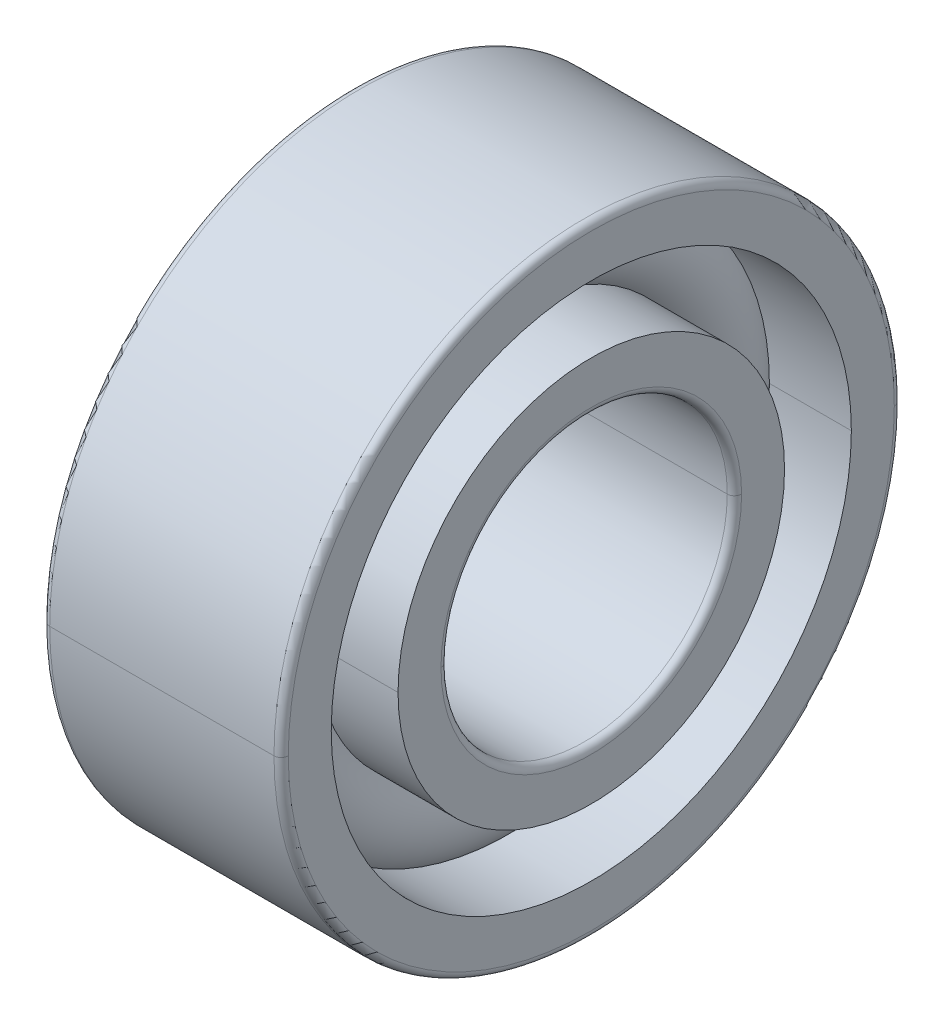
ISO-10303-21;
HEADER;
FILE_DESCRIPTION(('STEP AP214'),'2;1');
FILE_NAME('part.step','',(''),(''),'','','');
FILE_SCHEMA(('AUTOMOTIVE_DESIGN { 1 0 10303 214 1 1 1 1 }'));
ENDSEC;
DATA;
#1=APPLICATION_CONTEXT('core data for automotive mechanical design processes');
#2=APPLICATION_PROTOCOL_DEFINITION('international standard','automotive_design',2000,#1);
#3=PRODUCT_CONTEXT('',#1,'mechanical');
#4=PRODUCT('Part','Part','',(#3));
#5=PRODUCT_RELATED_PRODUCT_CATEGORY('part','',(#4));
#6=PRODUCT_DEFINITION_FORMATION('','',#4);
#7=PRODUCT_DEFINITION_CONTEXT('part definition',#1,'design');
#8=PRODUCT_DEFINITION('design','',#6,#7);
#9=PRODUCT_DEFINITION_SHAPE('','',#8);
#10=(LENGTH_UNIT() NAMED_UNIT(*) SI_UNIT(.MILLI.,.METRE.));
#11=(NAMED_UNIT(*) PLANE_ANGLE_UNIT() SI_UNIT($,.RADIAN.));
#12=(NAMED_UNIT(*) SI_UNIT($,.STERADIAN.) SOLID_ANGLE_UNIT());
#13=UNCERTAINTY_MEASURE_WITH_UNIT(LENGTH_MEASURE(1.E-05),#10,'distance_accuracy_value','');
#14=(GEOMETRIC_REPRESENTATION_CONTEXT(3) GLOBAL_UNCERTAINTY_ASSIGNED_CONTEXT((#13)) GLOBAL_UNIT_ASSIGNED_CONTEXT((#10,
#11,#12)) REPRESENTATION_CONTEXT('',''));
#15=CARTESIAN_POINT('',(0.,0.,0.));
#16=DIRECTION('',(0.,0.,1.));
#17=DIRECTION('',(1.,0.,0.));
#18=AXIS2_PLACEMENT_3D('',#15,#16,#17);
#19=CARTESIAN_POINT('',(-2.35,0.,0.));
#20=DIRECTION('',(1.,0.,0.));
#21=DIRECTION('',(0.,0.,-1.));
#22=AXIS2_PLACEMENT_3D('',#19,#20,#21);
#23=TOROIDAL_SURFACE('',#22,6.35,0.15);
#24=CARTESIAN_POINT('',(-2.5,0.,0.));
#25=DIRECTION('',(1.,0.,0.));
#26=DIRECTION('',(0.,0.,-1.));
#27=AXIS2_PLACEMENT_3D('',#24,#25,#26);
#28=CIRCLE('',#27,6.35);
#29=CARTESIAN_POINT('',(-2.5,0.,-6.35));
#30=VERTEX_POINT('',#29);
#31=CARTESIAN_POINT('',(-2.5,0.,6.35));
#32=VERTEX_POINT('',#31);
#33=EDGE_CURVE('E11',#30,#32,#28,.T.);
#34=ORIENTED_EDGE('',*,*,#33,.T.);
#35=CARTESIAN_POINT('',(-2.35,0.,6.35));
#36=DIRECTION('',(0.,1.,0.));
#37=DIRECTION('',(0.,0.,1.));
#38=AXIS2_PLACEMENT_3D('',#35,#36,#37);
#39=CIRCLE('',#38,0.15);
#40=CARTESIAN_POINT('',(-2.35,0.,6.5));
#41=VERTEX_POINT('',#40);
#42=EDGE_CURVE('E27',#32,#41,#39,.T.);
#43=ORIENTED_EDGE('',*,*,#42,.T.);
#44=CARTESIAN_POINT('',(-2.35,0.,0.));
#45=DIRECTION('',(1.,0.,0.));
#46=DIRECTION('',(0.,0.,-1.));
#47=AXIS2_PLACEMENT_3D('',#44,#45,#46);
#48=CIRCLE('',#47,6.5);
#49=CARTESIAN_POINT('',(-2.35,0.,-6.5));
#50=VERTEX_POINT('',#49);
#51=EDGE_CURVE('E323',#50,#41,#48,.T.);
#52=ORIENTED_EDGE('',*,*,#51,.F.);
#53=CARTESIAN_POINT('',(-2.35,0.,-6.35));
#54=DIRECTION('',(0.,-1.,0.));
#55=DIRECTION('',(0.,0.,-1.));
#56=AXIS2_PLACEMENT_3D('',#53,#54,#55);
#57=CIRCLE('',#56,0.15);
#58=EDGE_CURVE('E358',#30,#50,#57,.T.);
#59=ORIENTED_EDGE('',*,*,#58,.F.);
#60=EDGE_LOOP('',(#34,#43,#52,#59));
#61=FACE_BOUND('',#60,.T.);
#62=ADVANCED_FACE('F16',(#61),#23,.T.);
#63=CARTESIAN_POINT('',(-20.6375,0.,0.));
#64=DIRECTION('',(1.,0.,0.));
#65=DIRECTION('',(0.,0.,-1.));
#66=AXIS2_PLACEMENT_3D('',#63,#64,#65);
#67=CYLINDRICAL_SURFACE('',#66,6.5);
#68=ORIENTED_EDGE('',*,*,#51,.T.);
#69=DIRECTION('',(1.,0.,0.));
#70=VECTOR('',#69,1.);
#71=CARTESIAN_POINT('',(-20.6375,0.,6.5));
#72=LINE('',#71,#70);
#73=CARTESIAN_POINT('',(2.35,0.,6.5));
#74=VERTEX_POINT('',#73);
#75=EDGE_CURVE('E310',#41,#74,#72,.T.);
#76=ORIENTED_EDGE('',*,*,#75,.T.);
#77=CARTESIAN_POINT('',(2.35,0.,0.));
#78=DIRECTION('',(1.,0.,0.));
#79=DIRECTION('',(0.,0.,-1.));
#80=AXIS2_PLACEMENT_3D('',#77,#78,#79);
#81=CIRCLE('',#80,6.5);
#82=CARTESIAN_POINT('',(2.35,0.,-6.5));
#83=VERTEX_POINT('',#82);
#84=EDGE_CURVE('E245',#83,#74,#81,.T.);
#85=ORIENTED_EDGE('',*,*,#84,.F.);
#86=DIRECTION('',(1.,0.,0.));
#87=VECTOR('',#86,1.);
#88=CARTESIAN_POINT('',(-20.6375,0.,-6.5));
#89=LINE('',#88,#87);
#90=EDGE_CURVE('E207',#50,#83,#89,.T.);
#91=ORIENTED_EDGE('',*,*,#90,.F.);
#92=EDGE_LOOP('',(#68,#76,#85,#91));
#93=FACE_BOUND('',#92,.T.);
#94=ADVANCED_FACE('F478',(#93),#67,.T.);
#95=CARTESIAN_POINT('',(2.35,0.,0.));
#96=DIRECTION('',(1.,0.,0.));
#97=DIRECTION('',(0.,0.,-1.));
#98=AXIS2_PLACEMENT_3D('',#95,#96,#97);
#99=TOROIDAL_SURFACE('',#98,6.35,0.15);
#100=ORIENTED_EDGE('',*,*,#84,.T.);
#101=CARTESIAN_POINT('',(2.35,0.,6.35));
#102=DIRECTION('',(0.,1.,0.));
#103=DIRECTION('',(0.,0.,1.));
#104=AXIS2_PLACEMENT_3D('',#101,#102,#103);
#105=CIRCLE('',#104,0.15);
#106=CARTESIAN_POINT('',(2.5,0.,6.35));
#107=VERTEX_POINT('',#106);
#108=EDGE_CURVE('E243',#74,#107,#105,.T.);
#109=ORIENTED_EDGE('',*,*,#108,.T.);
#110=CARTESIAN_POINT('',(2.5,0.,0.));
#111=DIRECTION('',(1.,0.,0.));
#112=DIRECTION('',(0.,0.,-1.));
#113=AXIS2_PLACEMENT_3D('',#110,#111,#112);
#114=CIRCLE('',#113,6.35);
#115=CARTESIAN_POINT('',(2.5,0.,-6.35));
#116=VERTEX_POINT('',#115);
#117=EDGE_CURVE('E213',#116,#107,#114,.T.);
#118=ORIENTED_EDGE('',*,*,#117,.F.);
#119=CARTESIAN_POINT('',(2.35,0.,-6.35));
#120=DIRECTION('',(0.,-1.,0.));
#121=DIRECTION('',(0.,0.,-1.));
#122=AXIS2_PLACEMENT_3D('',#119,#120,#121);
#123=CIRCLE('',#122,0.15);
#124=EDGE_CURVE('E276',#83,#116,#123,.T.);
#125=ORIENTED_EDGE('',*,*,#124,.F.);
#126=EDGE_LOOP('',(#100,#109,#118,#125));
#127=FACE_BOUND('',#126,.T.);
#128=ADVANCED_FACE('F483',(#127),#99,.T.);
#129=CARTESIAN_POINT('',(-20.6375,0.,0.));
#130=DIRECTION('',(1.,0.,0.));
#131=DIRECTION('',(0.,0.,-1.));
#132=AXIS2_PLACEMENT_3D('',#129,#130,#131);
#133=CYLINDRICAL_SURFACE('',#132,5.45);
#134=CARTESIAN_POINT('',(-2.5,0.,0.));
#135=DIRECTION('',(1.,0.,0.));
#136=DIRECTION('',(0.,0.,-1.));
#137=AXIS2_PLACEMENT_3D('',#134,#135,#136);
#138=CIRCLE('',#137,5.45);
#139=CARTESIAN_POINT('',(-2.5,0.,5.45));
#140=VERTEX_POINT('',#139);
#141=CARTESIAN_POINT('',(-2.5,0.,-5.45));
#142=VERTEX_POINT('',#141);
#143=EDGE_CURVE('E95',#140,#142,#138,.T.);
#144=ORIENTED_EDGE('',*,*,#143,.F.);
#145=DIRECTION('',(1.,0.,0.));
#146=VECTOR('',#145,1.);
#147=CARTESIAN_POINT('',(-20.6375,0.,5.45));
#148=LINE('',#147,#146);
#149=CARTESIAN_POINT('',(-0.782623792124921,0.,5.45));
#150=VERTEX_POINT('',#149);
#151=EDGE_CURVE('E246',#140,#150,#148,.T.);
#152=ORIENTED_EDGE('',*,*,#151,.T.);
#153=CARTESIAN_POINT('',(-0.782623792124921,0.,0.));
#154=DIRECTION('',(-1.,0.,0.));
#155=DIRECTION('',(0.,0.,-1.));
#156=AXIS2_PLACEMENT_3D('',#153,#154,#155);
#157=CIRCLE('',#156,5.45);
#158=CARTESIAN_POINT('',(-0.782623792124921,0.,-5.45));
#159=VERTEX_POINT('',#158);
#160=EDGE_CURVE('E196',#159,#150,#157,.T.);
#161=ORIENTED_EDGE('',*,*,#160,.F.);
#162=DIRECTION('',(1.,0.,0.));
#163=VECTOR('',#162,1.);
#164=CARTESIAN_POINT('',(-20.6375,0.,-5.45));
#165=LINE('',#164,#163);
#166=EDGE_CURVE('E195',#142,#159,#165,.T.);
#167=ORIENTED_EDGE('',*,*,#166,.F.);
#168=EDGE_LOOP('',(#144,#152,#161,#167));
#169=FACE_BOUND('',#168,.T.);
#170=ADVANCED_FACE('F426',(#169),#133,.F.);
#171=CARTESIAN_POINT('',(-20.6375,0.,0.));
#172=DIRECTION('',(1.,0.,0.));
#173=DIRECTION('',(0.,0.,-1.));
#174=AXIS2_PLACEMENT_3D('',#171,#172,#173);
#175=CYLINDRICAL_SURFACE('',#174,5.45);
#176=CARTESIAN_POINT('',(0.782623792124921,0.,0.));
#177=DIRECTION('',(1.,0.,0.));
#178=DIRECTION('',(0.,0.,1.));
#179=AXIS2_PLACEMENT_3D('',#176,#177,#178);
#180=CIRCLE('',#179,5.45);
#181=CARTESIAN_POINT('',(0.782623792124921,0.,5.45));
#182=VERTEX_POINT('',#181);
#183=CARTESIAN_POINT('',(0.782623792124921,0.,-5.45));
#184=VERTEX_POINT('',#183);
#185=EDGE_CURVE('E108',#182,#184,#180,.T.);
#186=ORIENTED_EDGE('',*,*,#185,.F.);
#187=DIRECTION('',(1.,0.,0.));
#188=VECTOR('',#187,1.);
#189=CARTESIAN_POINT('',(-20.6375,0.,5.45));
#190=LINE('',#189,#188);
#191=CARTESIAN_POINT('',(2.5,0.,5.45));
#192=VERTEX_POINT('',#191);
#193=EDGE_CURVE('E260',#182,#192,#190,.T.);
#194=ORIENTED_EDGE('',*,*,#193,.T.);
#195=CARTESIAN_POINT('',(2.5,0.,0.));
#196=DIRECTION('',(1.,0.,0.));
#197=DIRECTION('',(0.,0.,-1.));
#198=AXIS2_PLACEMENT_3D('',#195,#196,#197);
#199=CIRCLE('',#198,5.45);
#200=CARTESIAN_POINT('',(2.5,0.,-5.45));
#201=VERTEX_POINT('',#200);
#202=EDGE_CURVE('E119',#192,#201,#199,.T.);
#203=ORIENTED_EDGE('',*,*,#202,.T.);
#204=DIRECTION('',(1.,0.,0.));
#205=VECTOR('',#204,1.);
#206=CARTESIAN_POINT('',(-20.6375,0.,-5.45));
#207=LINE('',#206,#205);
#208=EDGE_CURVE('E194',#184,#201,#207,.T.);
#209=ORIENTED_EDGE('',*,*,#208,.F.);
#210=EDGE_LOOP('',(#186,#194,#203,#209));
#211=FACE_BOUND('',#210,.T.);
#212=ADVANCED_FACE('F518',(#211),#175,.F.);
#213=CARTESIAN_POINT('',(0.,0.,0.));
#214=DIRECTION('',(-1.,0.,0.));
#215=DIRECTION('',(0.,0.,1.));
#216=AXIS2_PLACEMENT_3D('',#213,#214,#215);
#217=TOROIDAL_SURFACE('',#216,4.75,1.05);
#218=CARTESIAN_POINT('',(-0.782623792124921,0.,0.));
#219=DIRECTION('',(-1.,0.,0.));
#220=DIRECTION('',(0.,0.,-1.));
#221=AXIS2_PLACEMENT_3D('',#218,#219,#220);
#222=CIRCLE('',#221,5.45);
#223=EDGE_CURVE('E261',#150,#159,#222,.T.);
#224=ORIENTED_EDGE('',*,*,#223,.T.);
#225=CARTESIAN_POINT('',(0.,0.,-4.75));
#226=DIRECTION('',(0.,1.,0.));
#227=DIRECTION('',(0.,0.,1.));
#228=AXIS2_PLACEMENT_3D('',#225,#226,#227);
#229=CIRCLE('',#228,1.05);
#230=CARTESIAN_POINT('',(-0.782623792124926,0.,-4.05));
#231=VERTEX_POINT('',#230);
#232=EDGE_CURVE('E262',#159,#231,#229,.T.);
#233=ORIENTED_EDGE('',*,*,#232,.T.);
#234=CARTESIAN_POINT('',(-0.782623792124926,0.,0.));
#235=DIRECTION('',(1.,0.,0.));
#236=DIRECTION('',(0.,0.,-1.));
#237=AXIS2_PLACEMENT_3D('',#234,#235,#236);
#238=CIRCLE('',#237,4.05);
#239=CARTESIAN_POINT('',(-0.782623792124926,0.,4.05));
#240=VERTEX_POINT('',#239);
#241=EDGE_CURVE('E266',#231,#240,#238,.T.);
#242=ORIENTED_EDGE('',*,*,#241,.T.);
#243=CARTESIAN_POINT('',(0.,0.,4.75));
#244=DIRECTION('',(0.,-1.,0.));
#245=DIRECTION('',(0.,0.,-1.));
#246=AXIS2_PLACEMENT_3D('',#243,#244,#245);
#247=CIRCLE('',#246,1.05);
#248=EDGE_CURVE('E201',#150,#240,#247,.T.);
#249=ORIENTED_EDGE('',*,*,#248,.F.);
#250=EDGE_LOOP('',(#224,#233,#242,#249));
#251=FACE_BOUND('',#250,.T.);
#252=ADVANCED_FACE('F428',(#251),#217,.T.);
#253=CARTESIAN_POINT('',(-2.35,0.,0.));
#254=DIRECTION('',(1.,0.,0.));
#255=DIRECTION('',(0.,0.,-1.));
#256=AXIS2_PLACEMENT_3D('',#253,#254,#255);
#257=TOROIDAL_SURFACE('',#256,3.15,0.15);
#258=CARTESIAN_POINT('',(-2.35,0.,0.));
#259=DIRECTION('',(1.,0.,0.));
#260=DIRECTION('',(0.,0.,-1.));
#261=AXIS2_PLACEMENT_3D('',#258,#259,#260);
#262=CIRCLE('',#261,3.);
#263=CARTESIAN_POINT('',(-2.35,0.,-3.));
#264=VERTEX_POINT('',#263);
#265=CARTESIAN_POINT('',(-2.35,0.,3.));
#266=VERTEX_POINT('',#265);
#267=EDGE_CURVE('E188',#264,#266,#262,.T.);
#268=ORIENTED_EDGE('',*,*,#267,.T.);
#269=CARTESIAN_POINT('',(-2.35,0.,3.15));
#270=DIRECTION('',(0.,1.,0.));
#271=DIRECTION('',(0.,0.,1.));
#272=AXIS2_PLACEMENT_3D('',#269,#270,#271);
#273=CIRCLE('',#272,0.15);
#274=CARTESIAN_POINT('',(-2.5,0.,3.15));
#275=VERTEX_POINT('',#274);
#276=EDGE_CURVE('E185',#266,#275,#273,.T.);
#277=ORIENTED_EDGE('',*,*,#276,.T.);
#278=CARTESIAN_POINT('',(-2.5,0.,0.));
#279=DIRECTION('',(1.,0.,0.));
#280=DIRECTION('',(0.,0.,-1.));
#281=AXIS2_PLACEMENT_3D('',#278,#279,#280);
#282=CIRCLE('',#281,3.15);
#283=CARTESIAN_POINT('',(-2.5,0.,-3.15));
#284=VERTEX_POINT('',#283);
#285=EDGE_CURVE('E257',#284,#275,#282,.T.);
#286=ORIENTED_EDGE('',*,*,#285,.F.);
#287=CARTESIAN_POINT('',(-2.35,0.,-3.15));
#288=DIRECTION('',(0.,-1.,0.));
#289=DIRECTION('',(0.,0.,-1.));
#290=AXIS2_PLACEMENT_3D('',#287,#288,#289);
#291=CIRCLE('',#290,0.15);
#292=EDGE_CURVE('E314',#264,#284,#291,.T.);
#293=ORIENTED_EDGE('',*,*,#292,.F.);
#294=EDGE_LOOP('',(#268,#277,#286,#293));
#295=FACE_BOUND('',#294,.T.);
#296=ADVANCED_FACE('F448',(#295),#257,.T.);
#297=CARTESIAN_POINT('',(-20.6375,0.,0.));
#298=DIRECTION('',(1.,0.,0.));
#299=DIRECTION('',(0.,0.,-1.));
#300=AXIS2_PLACEMENT_3D('',#297,#298,#299);
#301=CYLINDRICAL_SURFACE('',#300,3.);
#302=CARTESIAN_POINT('',(-2.35,0.,0.));
#303=DIRECTION('',(1.,0.,0.));
#304=DIRECTION('',(0.,0.,-1.));
#305=AXIS2_PLACEMENT_3D('',#302,#303,#304);
#306=CIRCLE('',#305,3.);
#307=EDGE_CURVE('E287',#266,#264,#306,.T.);
#308=ORIENTED_EDGE('',*,*,#307,.F.);
#309=DIRECTION('',(1.,0.,0.));
#310=VECTOR('',#309,1.);
#311=CARTESIAN_POINT('',(-20.6375,0.,3.));
#312=LINE('',#311,#310);
#313=CARTESIAN_POINT('',(2.35,0.,3.));
#314=VERTEX_POINT('',#313);
#315=EDGE_CURVE('E189',#266,#314,#312,.T.);
#316=ORIENTED_EDGE('',*,*,#315,.T.);
#317=CARTESIAN_POINT('',(2.35,0.,0.));
#318=DIRECTION('',(1.,0.,0.));
#319=DIRECTION('',(0.,0.,-1.));
#320=AXIS2_PLACEMENT_3D('',#317,#318,#319);
#321=CIRCLE('',#320,3.);
#322=CARTESIAN_POINT('',(2.35,0.,-3.));
#323=VERTEX_POINT('',#322);
#324=EDGE_CURVE('E296',#314,#323,#321,.T.);
#325=ORIENTED_EDGE('',*,*,#324,.T.);
#326=DIRECTION('',(1.,0.,0.));
#327=VECTOR('',#326,1.);
#328=CARTESIAN_POINT('',(-20.6375,0.,-3.));
#329=LINE('',#328,#327);
#330=EDGE_CURVE('E286',#264,#323,#329,.T.);
#331=ORIENTED_EDGE('',*,*,#330,.F.);
#332=EDGE_LOOP('',(#308,#316,#325,#331));
#333=FACE_BOUND('',#332,.T.);
#334=ADVANCED_FACE('F455',(#333),#301,.F.);
#335=CARTESIAN_POINT('',(2.35,0.,0.));
#336=DIRECTION('',(1.,0.,0.));
#337=DIRECTION('',(0.,0.,-1.));
#338=AXIS2_PLACEMENT_3D('',#335,#336,#337);
#339=TOROIDAL_SURFACE('',#338,3.15,0.15);
#340=CARTESIAN_POINT('',(2.5,0.,0.));
#341=DIRECTION('',(1.,0.,0.));
#342=DIRECTION('',(0.,0.,-1.));
#343=AXIS2_PLACEMENT_3D('',#340,#341,#342);
#344=CIRCLE('',#343,3.15);
#345=CARTESIAN_POINT('',(2.5,0.,-3.15));
#346=VERTEX_POINT('',#345);
#347=CARTESIAN_POINT('',(2.5,0.,3.15));
#348=VERTEX_POINT('',#347);
#349=EDGE_CURVE('E300',#346,#348,#344,.T.);
#350=ORIENTED_EDGE('',*,*,#349,.T.);
#351=CARTESIAN_POINT('',(2.35,0.,3.15));
#352=DIRECTION('',(0.,1.,0.));
#353=DIRECTION('',(0.,0.,1.));
#354=AXIS2_PLACEMENT_3D('',#351,#352,#353);
#355=CIRCLE('',#354,0.15);
#356=EDGE_CURVE('E238',#348,#314,#355,.T.);
#357=ORIENTED_EDGE('',*,*,#356,.T.);
#358=CARTESIAN_POINT('',(2.35,0.,0.));
#359=DIRECTION('',(1.,0.,0.));
#360=DIRECTION('',(0.,0.,-1.));
#361=AXIS2_PLACEMENT_3D('',#358,#359,#360);
#362=CIRCLE('',#361,3.);
#363=EDGE_CURVE('E282',#323,#314,#362,.T.);
#364=ORIENTED_EDGE('',*,*,#363,.F.);
#365=CARTESIAN_POINT('',(2.35,0.,-3.15));
#366=DIRECTION('',(0.,-1.,0.));
#367=DIRECTION('',(0.,0.,-1.));
#368=AXIS2_PLACEMENT_3D('',#365,#366,#367);
#369=CIRCLE('',#368,0.15);
#370=EDGE_CURVE('E179',#346,#323,#369,.T.);
#371=ORIENTED_EDGE('',*,*,#370,.F.);
#372=EDGE_LOOP('',(#350,#357,#364,#371));
#373=FACE_BOUND('',#372,.T.);
#374=ADVANCED_FACE('F463',(#373),#339,.T.);
#375=CARTESIAN_POINT('',(-20.6375,0.,0.));
#376=DIRECTION('',(1.,0.,0.));
#377=DIRECTION('',(0.,0.,-1.));
#378=AXIS2_PLACEMENT_3D('',#375,#376,#377);
#379=CYLINDRICAL_SURFACE('',#378,4.05);
#380=CARTESIAN_POINT('',(-2.5,0.,0.));
#381=DIRECTION('',(1.,0.,0.));
#382=DIRECTION('',(0.,0.,-1.));
#383=AXIS2_PLACEMENT_3D('',#380,#381,#382);
#384=CIRCLE('',#383,4.05);
#385=CARTESIAN_POINT('',(-2.5,0.,-4.05));
#386=VERTEX_POINT('',#385);
#387=CARTESIAN_POINT('',(-2.5,0.,4.05));
#388=VERTEX_POINT('',#387);
#389=EDGE_CURVE('E240',#386,#388,#384,.T.);
#390=ORIENTED_EDGE('',*,*,#389,.T.);
#391=DIRECTION('',(1.,0.,0.));
#392=VECTOR('',#391,1.);
#393=CARTESIAN_POINT('',(-20.6375,0.,4.05));
#394=LINE('',#393,#392);
#395=EDGE_CURVE('E166',#388,#240,#394,.T.);
#396=ORIENTED_EDGE('',*,*,#395,.T.);
#397=ORIENTED_EDGE('',*,*,#241,.F.);
#398=DIRECTION('',(1.,0.,0.));
#399=VECTOR('',#398,1.);
#400=CARTESIAN_POINT('',(-20.6375,0.,-4.05));
#401=LINE('',#400,#399);
#402=EDGE_CURVE('E155',#386,#231,#401,.T.);
#403=ORIENTED_EDGE('',*,*,#402,.F.);
#404=EDGE_LOOP('',(#390,#396,#397,#403));
#405=FACE_BOUND('',#404,.T.);
#406=ADVANCED_FACE('F435',(#405),#379,.T.);
#407=CARTESIAN_POINT('',(-20.6375,0.,0.));
#408=DIRECTION('',(1.,0.,0.));
#409=DIRECTION('',(0.,0.,-1.));
#410=AXIS2_PLACEMENT_3D('',#407,#408,#409);
#411=CYLINDRICAL_SURFACE('',#410,4.05);
#412=CARTESIAN_POINT('',(0.782623792124926,0.,0.));
#413=DIRECTION('',(-1.,0.,0.));
#414=DIRECTION('',(0.,0.,1.));
#415=AXIS2_PLACEMENT_3D('',#412,#413,#414);
#416=CIRCLE('',#415,4.05);
#417=CARTESIAN_POINT('',(0.782623792124926,0.,4.05));
#418=VERTEX_POINT('',#417);
#419=CARTESIAN_POINT('',(0.782623792124926,0.,-4.05));
#420=VERTEX_POINT('',#419);
#421=EDGE_CURVE('E161',#418,#420,#416,.T.);
#422=ORIENTED_EDGE('',*,*,#421,.F.);
#423=DIRECTION('',(1.,0.,0.));
#424=VECTOR('',#423,1.);
#425=CARTESIAN_POINT('',(-20.6375,0.,4.05));
#426=LINE('',#425,#424);
#427=CARTESIAN_POINT('',(2.5,0.,4.05));
#428=VERTEX_POINT('',#427);
#429=EDGE_CURVE('E158',#418,#428,#426,.T.);
#430=ORIENTED_EDGE('',*,*,#429,.T.);
#431=CARTESIAN_POINT('',(2.5,0.,0.));
#432=DIRECTION('',(1.,0.,0.));
#433=DIRECTION('',(0.,0.,-1.));
#434=AXIS2_PLACEMENT_3D('',#431,#432,#433);
#435=CIRCLE('',#434,4.05);
#436=CARTESIAN_POINT('',(2.5,0.,-4.05));
#437=VERTEX_POINT('',#436);
#438=EDGE_CURVE('E20',#437,#428,#435,.T.);
#439=ORIENTED_EDGE('',*,*,#438,.F.);
#440=DIRECTION('',(1.,0.,0.));
#441=VECTOR('',#440,1.);
#442=CARTESIAN_POINT('',(-20.6375,0.,-4.05));
#443=LINE('',#442,#441);
#444=EDGE_CURVE('E169',#420,#437,#443,.T.);
#445=ORIENTED_EDGE('',*,*,#444,.F.);
#446=EDGE_LOOP('',(#422,#430,#439,#445));
#447=FACE_BOUND('',#446,.T.);
#448=ADVANCED_FACE('F159',(#447),#411,.T.);
#449=CARTESIAN_POINT('',(0.,0.,0.));
#450=DIRECTION('',(-1.,0.,0.));
#451=DIRECTION('',(0.,0.,1.));
#452=AXIS2_PLACEMENT_3D('',#449,#450,#451);
#453=TOROIDAL_SURFACE('',#452,4.75,1.05);
#454=ORIENTED_EDGE('',*,*,#421,.T.);
#455=CARTESIAN_POINT('',(0.,0.,-4.75));
#456=DIRECTION('',(0.,1.,0.));
#457=DIRECTION('',(0.,0.,1.));
#458=AXIS2_PLACEMENT_3D('',#455,#456,#457);
#459=CIRCLE('',#458,1.05);
#460=EDGE_CURVE('E320',#420,#184,#459,.T.);
#461=ORIENTED_EDGE('',*,*,#460,.T.);
#462=CARTESIAN_POINT('',(0.782623792124921,0.,0.));
#463=DIRECTION('',(1.,0.,0.));
#464=DIRECTION('',(0.,0.,1.));
#465=AXIS2_PLACEMENT_3D('',#462,#463,#464);
#466=CIRCLE('',#465,5.45);
#467=EDGE_CURVE('E303',#184,#182,#466,.T.);
#468=ORIENTED_EDGE('',*,*,#467,.T.);
#469=CARTESIAN_POINT('',(0.,0.,4.75));
#470=DIRECTION('',(0.,-1.,0.));
#471=DIRECTION('',(0.,0.,-1.));
#472=AXIS2_PLACEMENT_3D('',#469,#470,#471);
#473=CIRCLE('',#472,1.05);
#474=EDGE_CURVE('E202',#418,#182,#473,.T.);
#475=ORIENTED_EDGE('',*,*,#474,.F.);
#476=EDGE_LOOP('',(#454,#461,#468,#475));
#477=FACE_BOUND('',#476,.T.);
#478=ADVANCED_FACE('F380',(#477),#453,.T.);
#479=CARTESIAN_POINT('',(0.,0.,0.));
#480=DIRECTION('',(-1.,0.,0.));
#481=DIRECTION('',(0.,0.,1.));
#482=AXIS2_PLACEMENT_3D('',#479,#480,#481);
#483=TOROIDAL_SURFACE('',#482,4.75,1.05);
#484=ORIENTED_EDGE('',*,*,#460,.F.);
#485=CARTESIAN_POINT('',(0.782623792124926,0.,0.));
#486=DIRECTION('',(-1.,0.,0.));
#487=DIRECTION('',(0.,0.,1.));
#488=AXIS2_PLACEMENT_3D('',#485,#486,#487);
#489=CIRCLE('',#488,4.05);
#490=EDGE_CURVE('E206',#420,#418,#489,.T.);
#491=ORIENTED_EDGE('',*,*,#490,.T.);
#492=ORIENTED_EDGE('',*,*,#474,.T.);
#493=ORIENTED_EDGE('',*,*,#185,.T.);
#494=EDGE_LOOP('',(#484,#491,#492,#493));
#495=FACE_BOUND('',#494,.T.);
#496=ADVANCED_FACE('F385',(#495),#483,.T.);
#497=CARTESIAN_POINT('',(-20.6375,0.,0.));
#498=DIRECTION('',(1.,0.,0.));
#499=DIRECTION('',(0.,0.,-1.));
#500=AXIS2_PLACEMENT_3D('',#497,#498,#499);
#501=CYLINDRICAL_SURFACE('',#500,4.05);
#502=ORIENTED_EDGE('',*,*,#429,.F.);
#503=ORIENTED_EDGE('',*,*,#490,.F.);
#504=ORIENTED_EDGE('',*,*,#444,.T.);
#505=CARTESIAN_POINT('',(2.5,0.,0.));
#506=DIRECTION('',(1.,0.,0.));
#507=DIRECTION('',(0.,0.,-1.));
#508=AXIS2_PLACEMENT_3D('',#505,#506,#507);
#509=CIRCLE('',#508,4.05);
#510=EDGE_CURVE('E150',#428,#437,#509,.T.);
#511=ORIENTED_EDGE('',*,*,#510,.F.);
#512=EDGE_LOOP('',(#502,#503,#504,#511));
#513=FACE_BOUND('',#512,.T.);
#514=ADVANCED_FACE('F168',(#513),#501,.T.);
#515=CARTESIAN_POINT('',(-20.6375,0.,0.));
#516=DIRECTION('',(1.,0.,0.));
#517=DIRECTION('',(0.,0.,-1.));
#518=AXIS2_PLACEMENT_3D('',#515,#516,#517);
#519=CYLINDRICAL_SURFACE('',#518,4.05);
#520=ORIENTED_EDGE('',*,*,#395,.F.);
#521=CARTESIAN_POINT('',(-2.5,0.,0.));
#522=DIRECTION('',(1.,0.,0.));
#523=DIRECTION('',(0.,0.,-1.));
#524=AXIS2_PLACEMENT_3D('',#521,#522,#523);
#525=CIRCLE('',#524,4.05);
#526=EDGE_CURVE('E253',#388,#386,#525,.T.);
#527=ORIENTED_EDGE('',*,*,#526,.T.);
#528=ORIENTED_EDGE('',*,*,#402,.T.);
#529=CARTESIAN_POINT('',(-0.782623792124926,0.,0.));
#530=DIRECTION('',(1.,0.,0.));
#531=DIRECTION('',(0.,0.,-1.));
#532=AXIS2_PLACEMENT_3D('',#529,#530,#531);
#533=CIRCLE('',#532,4.05);
#534=EDGE_CURVE('E250',#240,#231,#533,.T.);
#535=ORIENTED_EDGE('',*,*,#534,.F.);
#536=EDGE_LOOP('',(#520,#527,#528,#535));
#537=FACE_BOUND('',#536,.T.);
#538=ADVANCED_FACE('F439',(#537),#519,.T.);
#539=CARTESIAN_POINT('',(2.5,3.15,0.));
#540=DIRECTION('',(1.,0.,0.));
#541=DIRECTION('',(0.,1.,0.));
#542=AXIS2_PLACEMENT_3D('',#539,#540,#541);
#543=PLANE('',#542);
#544=ORIENTED_EDGE('',*,*,#438,.T.);
#545=ORIENTED_EDGE('',*,*,#510,.T.);
#546=EDGE_LOOP('',(#544,#545));
#547=FACE_BOUND('',#546,.T.);
#548=ORIENTED_EDGE('',*,*,#349,.F.);
#549=CARTESIAN_POINT('',(2.5,0.,0.));
#550=DIRECTION('',(1.,0.,0.));
#551=DIRECTION('',(0.,0.,-1.));
#552=AXIS2_PLACEMENT_3D('',#549,#550,#551);
#553=CIRCLE('',#552,3.15);
#554=EDGE_CURVE('E171',#348,#346,#553,.T.);
#555=ORIENTED_EDGE('',*,*,#554,.F.);
#556=EDGE_LOOP('',(#548,#555));
#557=FACE_BOUND('',#556,.T.);
#558=ADVANCED_FACE('F147',(#547,#557),#543,.T.);
#559=CARTESIAN_POINT('',(2.35,0.,0.));
#560=DIRECTION('',(1.,0.,0.));
#561=DIRECTION('',(0.,0.,-1.));
#562=AXIS2_PLACEMENT_3D('',#559,#560,#561);
#563=TOROIDAL_SURFACE('',#562,3.15,0.15);
#564=ORIENTED_EDGE('',*,*,#356,.F.);
#565=ORIENTED_EDGE('',*,*,#554,.T.);
#566=ORIENTED_EDGE('',*,*,#370,.T.);
#567=ORIENTED_EDGE('',*,*,#324,.F.);
#568=EDGE_LOOP('',(#564,#565,#566,#567));
#569=FACE_BOUND('',#568,.T.);
#570=ADVANCED_FACE('F459',(#569),#563,.T.);
#571=CARTESIAN_POINT('',(-20.6375,0.,0.));
#572=DIRECTION('',(1.,0.,0.));
#573=DIRECTION('',(0.,0.,-1.));
#574=AXIS2_PLACEMENT_3D('',#571,#572,#573);
#575=CYLINDRICAL_SURFACE('',#574,3.);
#576=ORIENTED_EDGE('',*,*,#315,.F.);
#577=ORIENTED_EDGE('',*,*,#267,.F.);
#578=ORIENTED_EDGE('',*,*,#330,.T.);
#579=ORIENTED_EDGE('',*,*,#363,.T.);
#580=EDGE_LOOP('',(#576,#577,#578,#579));
#581=FACE_BOUND('',#580,.T.);
#582=ADVANCED_FACE('F18',(#581),#575,.F.);
#583=CARTESIAN_POINT('',(-2.35,0.,0.));
#584=DIRECTION('',(1.,0.,0.));
#585=DIRECTION('',(0.,0.,-1.));
#586=AXIS2_PLACEMENT_3D('',#583,#584,#585);
#587=TOROIDAL_SURFACE('',#586,3.15,0.15);
#588=ORIENTED_EDGE('',*,*,#276,.F.);
#589=ORIENTED_EDGE('',*,*,#307,.T.);
#590=ORIENTED_EDGE('',*,*,#292,.T.);
#591=CARTESIAN_POINT('',(-2.5,0.,0.));
#592=DIRECTION('',(1.,0.,0.));
#593=DIRECTION('',(0.,0.,-1.));
#594=AXIS2_PLACEMENT_3D('',#591,#592,#593);
#595=CIRCLE('',#594,3.15);
#596=EDGE_CURVE('E200',#275,#284,#595,.T.);
#597=ORIENTED_EDGE('',*,*,#596,.F.);
#598=EDGE_LOOP('',(#588,#589,#590,#597));
#599=FACE_BOUND('',#598,.T.);
#600=ADVANCED_FACE('F444',(#599),#587,.T.);
#601=CARTESIAN_POINT('',(-2.5,4.05,0.));
#602=DIRECTION('',(-1.,0.,0.));
#603=DIRECTION('',(0.,0.,1.));
#604=AXIS2_PLACEMENT_3D('',#601,#602,#603);
#605=PLANE('',#604);
#606=ORIENTED_EDGE('',*,*,#389,.F.);
#607=ORIENTED_EDGE('',*,*,#526,.F.);
#608=EDGE_LOOP('',(#606,#607));
#609=FACE_BOUND('',#608,.T.);
#610=ORIENTED_EDGE('',*,*,#285,.T.);
#611=ORIENTED_EDGE('',*,*,#596,.T.);
#612=EDGE_LOOP('',(#610,#611));
#613=FACE_BOUND('',#612,.T.);
#614=ADVANCED_FACE('F441',(#609,#613),#605,.T.);
#615=CARTESIAN_POINT('',(0.,0.,0.));
#616=DIRECTION('',(-1.,0.,0.));
#617=DIRECTION('',(0.,0.,1.));
#618=AXIS2_PLACEMENT_3D('',#615,#616,#617);
#619=TOROIDAL_SURFACE('',#618,4.75,1.05);
#620=ORIENTED_EDGE('',*,*,#232,.F.);
#621=ORIENTED_EDGE('',*,*,#160,.T.);
#622=ORIENTED_EDGE('',*,*,#248,.T.);
#623=ORIENTED_EDGE('',*,*,#534,.T.);
#624=EDGE_LOOP('',(#620,#621,#622,#623));
#625=FACE_BOUND('',#624,.T.);
#626=ADVANCED_FACE('F433',(#625),#619,.T.);
#627=CARTESIAN_POINT('',(-20.6375,0.,0.));
#628=DIRECTION('',(1.,0.,0.));
#629=DIRECTION('',(0.,0.,-1.));
#630=AXIS2_PLACEMENT_3D('',#627,#628,#629);
#631=CYLINDRICAL_SURFACE('',#630,5.45);
#632=ORIENTED_EDGE('',*,*,#193,.F.);
#633=ORIENTED_EDGE('',*,*,#467,.F.);
#634=ORIENTED_EDGE('',*,*,#208,.T.);
#635=CARTESIAN_POINT('',(2.5,0.,0.));
#636=DIRECTION('',(1.,0.,0.));
#637=DIRECTION('',(0.,0.,-1.));
#638=AXIS2_PLACEMENT_3D('',#635,#636,#637);
#639=CIRCLE('',#638,5.45);
#640=EDGE_CURVE('E190',#201,#192,#639,.T.);
#641=ORIENTED_EDGE('',*,*,#640,.T.);
#642=EDGE_LOOP('',(#632,#633,#634,#641));
#643=FACE_BOUND('',#642,.T.);
#644=ADVANCED_FACE('F383',(#643),#631,.F.);
#645=CARTESIAN_POINT('',(-20.6375,0.,0.));
#646=DIRECTION('',(1.,0.,0.));
#647=DIRECTION('',(0.,0.,-1.));
#648=AXIS2_PLACEMENT_3D('',#645,#646,#647);
#649=CYLINDRICAL_SURFACE('',#648,5.45);
#650=ORIENTED_EDGE('',*,*,#151,.F.);
#651=CARTESIAN_POINT('',(-2.5,0.,0.));
#652=DIRECTION('',(1.,0.,0.));
#653=DIRECTION('',(0.,0.,-1.));
#654=AXIS2_PLACEMENT_3D('',#651,#652,#653);
#655=CIRCLE('',#654,5.45);
#656=EDGE_CURVE('E183',#142,#140,#655,.T.);
#657=ORIENTED_EDGE('',*,*,#656,.F.);
#658=ORIENTED_EDGE('',*,*,#166,.T.);
#659=ORIENTED_EDGE('',*,*,#223,.F.);
#660=EDGE_LOOP('',(#650,#657,#658,#659));
#661=FACE_BOUND('',#660,.T.);
#662=ADVANCED_FACE('F423',(#661),#649,.F.);
#663=CARTESIAN_POINT('',(2.5,6.35,0.));
#664=DIRECTION('',(1.,0.,0.));
#665=DIRECTION('',(0.,1.,0.));
#666=AXIS2_PLACEMENT_3D('',#663,#664,#665);
#667=PLANE('',#666);
#668=ORIENTED_EDGE('',*,*,#117,.T.);
#669=CARTESIAN_POINT('',(2.5,0.,0.));
#670=DIRECTION('',(1.,0.,0.));
#671=DIRECTION('',(0.,0.,-1.));
#672=AXIS2_PLACEMENT_3D('',#669,#670,#671);
#673=CIRCLE('',#672,6.35);
#674=EDGE_CURVE('E222',#107,#116,#673,.T.);
#675=ORIENTED_EDGE('',*,*,#674,.T.);
#676=EDGE_LOOP('',(#668,#675));
#677=FACE_BOUND('',#676,.T.);
#678=ORIENTED_EDGE('',*,*,#640,.F.);
#679=ORIENTED_EDGE('',*,*,#202,.F.);
#680=EDGE_LOOP('',(#678,#679));
#681=FACE_BOUND('',#680,.T.);
#682=ADVANCED_FACE('F497',(#677,#681),#667,.T.);
#683=CARTESIAN_POINT('',(2.35,0.,0.));
#684=DIRECTION('',(1.,0.,0.));
#685=DIRECTION('',(0.,0.,-1.));
#686=AXIS2_PLACEMENT_3D('',#683,#684,#685);
#687=TOROIDAL_SURFACE('',#686,6.35,0.15);
#688=ORIENTED_EDGE('',*,*,#108,.F.);
#689=CARTESIAN_POINT('',(2.35,0.,0.));
#690=DIRECTION('',(1.,0.,0.));
#691=DIRECTION('',(0.,0.,-1.));
#692=AXIS2_PLACEMENT_3D('',#689,#690,#691);
#693=CIRCLE('',#692,6.5);
#694=EDGE_CURVE('E234',#74,#83,#693,.T.);
#695=ORIENTED_EDGE('',*,*,#694,.T.);
#696=ORIENTED_EDGE('',*,*,#124,.T.);
#697=ORIENTED_EDGE('',*,*,#674,.F.);
#698=EDGE_LOOP('',(#688,#695,#696,#697));
#699=FACE_BOUND('',#698,.T.);
#700=ADVANCED_FACE('F516',(#699),#687,.T.);
#701=CARTESIAN_POINT('',(-20.6375,0.,0.));
#702=DIRECTION('',(1.,0.,0.));
#703=DIRECTION('',(0.,0.,-1.));
#704=AXIS2_PLACEMENT_3D('',#701,#702,#703);
#705=CYLINDRICAL_SURFACE('',#704,6.5);
#706=ORIENTED_EDGE('',*,*,#75,.F.);
#707=CARTESIAN_POINT('',(-2.35,0.,0.));
#708=DIRECTION('',(1.,0.,0.));
#709=DIRECTION('',(0.,0.,-1.));
#710=AXIS2_PLACEMENT_3D('',#707,#708,#709);
#711=CIRCLE('',#710,6.5);
#712=EDGE_CURVE('E210',#41,#50,#711,.T.);
#713=ORIENTED_EDGE('',*,*,#712,.T.);
#714=ORIENTED_EDGE('',*,*,#90,.T.);
#715=ORIENTED_EDGE('',*,*,#694,.F.);
#716=EDGE_LOOP('',(#706,#713,#714,#715));
#717=FACE_BOUND('',#716,.T.);
#718=ADVANCED_FACE('F491',(#717),#705,.T.);
#719=CARTESIAN_POINT('',(-2.35,0.,0.));
#720=DIRECTION('',(1.,0.,0.));
#721=DIRECTION('',(0.,0.,-1.));
#722=AXIS2_PLACEMENT_3D('',#719,#720,#721);
#723=TOROIDAL_SURFACE('',#722,6.35,0.15);
#724=ORIENTED_EDGE('',*,*,#42,.F.);
#725=CARTESIAN_POINT('',(-2.5,0.,0.));
#726=DIRECTION('',(1.,0.,0.));
#727=DIRECTION('',(0.,0.,-1.));
#728=AXIS2_PLACEMENT_3D('',#725,#726,#727);
#729=CIRCLE('',#728,6.35);
#730=EDGE_CURVE('E211',#32,#30,#729,.T.);
#731=ORIENTED_EDGE('',*,*,#730,.T.);
#732=ORIENTED_EDGE('',*,*,#58,.T.);
#733=ORIENTED_EDGE('',*,*,#712,.F.);
#734=EDGE_LOOP('',(#724,#731,#732,#733));
#735=FACE_BOUND('',#734,.T.);
#736=ADVANCED_FACE('F420',(#735),#723,.T.);
#737=CARTESIAN_POINT('',(-2.5,5.45,0.));
#738=DIRECTION('',(-1.,0.,0.));
#739=DIRECTION('',(0.,0.,1.));
#740=AXIS2_PLACEMENT_3D('',#737,#738,#739);
#741=PLANE('',#740);
#742=ORIENTED_EDGE('',*,*,#33,.F.);
#743=ORIENTED_EDGE('',*,*,#730,.F.);
#744=EDGE_LOOP('',(#742,#743));
#745=FACE_BOUND('',#744,.T.);
#746=ORIENTED_EDGE('',*,*,#656,.T.);
#747=ORIENTED_EDGE('',*,*,#143,.T.);
#748=EDGE_LOOP('',(#746,#747));
#749=FACE_BOUND('',#748,.T.);
#750=ADVANCED_FACE('F418',(#745,#749),#741,.T.);
#751=CLOSED_SHELL('',(#62,#94,#128,#170,#212,#252,#296,#334,#374,#406,#448,#478,#496,#514,#538,
#558,#570,#582,#600,#614,#626,#644,#662,#682,#700,#718,#736,#750));
#752=MANIFOLD_SOLID_BREP('B1',#751);
#753=ADVANCED_BREP_SHAPE_REPRESENTATION('',(#18,#752),#14);
#754=SHAPE_DEFINITION_REPRESENTATION(#9,#753);
ENDSEC;
END-ISO-10303-21;
